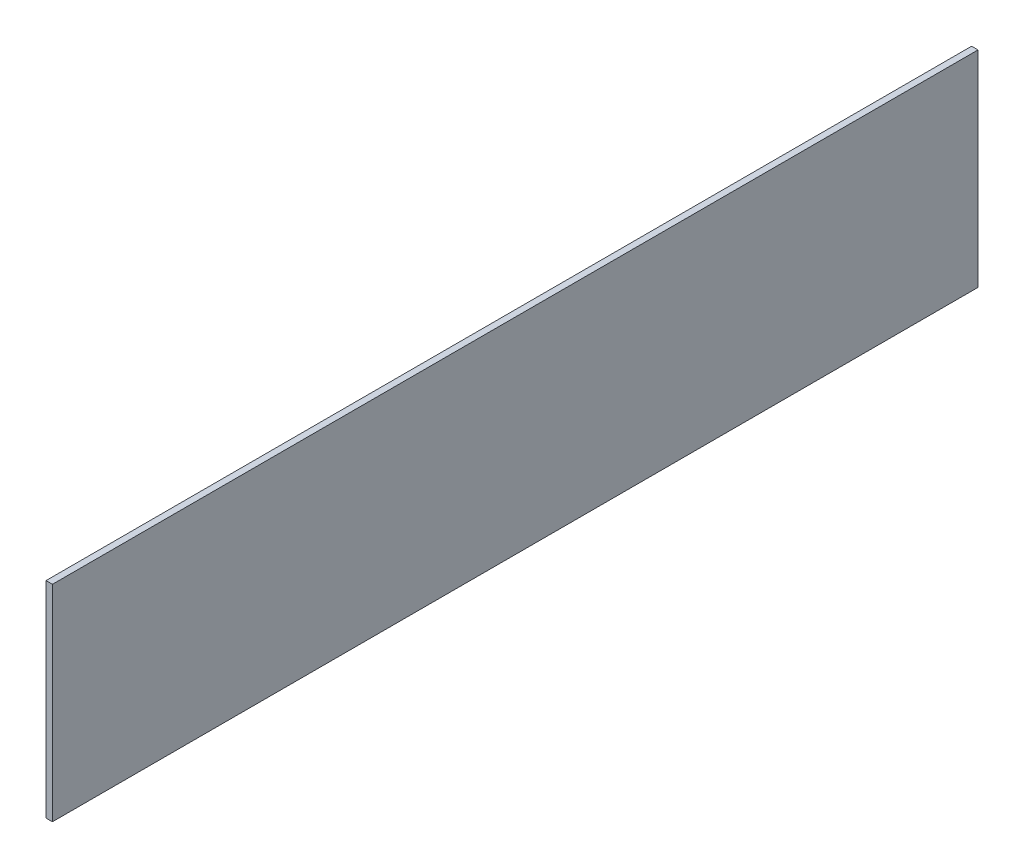
ISO-10303-21;
HEADER;
FILE_DESCRIPTION(('STEP AP214'),'2;1');
FILE_NAME('part.step','',(''),(''),'','','');
FILE_SCHEMA(('AUTOMOTIVE_DESIGN { 1 0 10303 214 1 1 1 1 }'));
ENDSEC;
DATA;
#1=APPLICATION_CONTEXT('core data for automotive mechanical design processes');
#2=APPLICATION_PROTOCOL_DEFINITION('international standard','automotive_design',2000,#1);
#3=PRODUCT_CONTEXT('',#1,'mechanical');
#4=PRODUCT('Part','Part','',(#3));
#5=PRODUCT_RELATED_PRODUCT_CATEGORY('part','',(#4));
#6=PRODUCT_DEFINITION_FORMATION('','',#4);
#7=PRODUCT_DEFINITION_CONTEXT('part definition',#1,'design');
#8=PRODUCT_DEFINITION('design','',#6,#7);
#9=PRODUCT_DEFINITION_SHAPE('','',#8);
#10=(LENGTH_UNIT() NAMED_UNIT(*) SI_UNIT(.MILLI.,.METRE.));
#11=(NAMED_UNIT(*) PLANE_ANGLE_UNIT() SI_UNIT($,.RADIAN.));
#12=(NAMED_UNIT(*) SI_UNIT($,.STERADIAN.) SOLID_ANGLE_UNIT());
#13=UNCERTAINTY_MEASURE_WITH_UNIT(LENGTH_MEASURE(1.E-05),#10,'distance_accuracy_value','');
#14=(GEOMETRIC_REPRESENTATION_CONTEXT(3) GLOBAL_UNCERTAINTY_ASSIGNED_CONTEXT((#13)) GLOBAL_UNIT_ASSIGNED_CONTEXT((#10,
#11,#12)) REPRESENTATION_CONTEXT('',''));
#15=CARTESIAN_POINT('',(0.,0.,0.));
#16=DIRECTION('',(0.,0.,1.));
#17=DIRECTION('',(1.,0.,0.));
#18=AXIS2_PLACEMENT_3D('',#15,#16,#17);
#19=CARTESIAN_POINT('',(0.79375,-25.4,114.3));
#20=DIRECTION('',(0.,0.,-1.));
#21=DIRECTION('',(-1.,0.,0.));
#22=AXIS2_PLACEMENT_3D('',#19,#20,#21);
#23=PLANE('',#22);
#24=DIRECTION('',(0.,-1.,0.));
#25=VECTOR('',#24,1.);
#26=CARTESIAN_POINT('',(-0.79375,-25.4,114.3));
#27=LINE('',#26,#25);
#28=CARTESIAN_POINT('',(-0.79375,25.4,114.3));
#29=VERTEX_POINT('',#28);
#30=CARTESIAN_POINT('',(-0.79375,-25.4,114.3));
#31=VERTEX_POINT('',#30);
#32=EDGE_CURVE('E107',#29,#31,#27,.T.);
#33=ORIENTED_EDGE('',*,*,#32,.T.);
#34=DIRECTION('',(-1.,0.,0.));
#35=VECTOR('',#34,1.);
#36=CARTESIAN_POINT('',(0.79375,-25.4,114.3));
#37=LINE('',#36,#35);
#38=CARTESIAN_POINT('',(0.79375,-25.4,114.3));
#39=VERTEX_POINT('',#38);
#40=EDGE_CURVE('E11',#39,#31,#37,.T.);
#41=ORIENTED_EDGE('',*,*,#40,.F.);
#42=DIRECTION('',(0.,-1.,0.));
#43=VECTOR('',#42,1.);
#44=CARTESIAN_POINT('',(0.79375,-25.4,114.3));
#45=LINE('',#44,#43);
#46=CARTESIAN_POINT('',(0.79375,25.4,114.3));
#47=VERTEX_POINT('',#46);
#48=EDGE_CURVE('E91',#47,#39,#45,.T.);
#49=ORIENTED_EDGE('',*,*,#48,.F.);
#50=DIRECTION('',(-1.,0.,0.));
#51=VECTOR('',#50,1.);
#52=CARTESIAN_POINT('',(0.79375,25.4,114.3));
#53=LINE('',#52,#51);
#54=EDGE_CURVE('E103',#47,#29,#53,.T.);
#55=ORIENTED_EDGE('',*,*,#54,.T.);
#56=EDGE_LOOP('',(#33,#41,#49,#55));
#57=FACE_BOUND('',#56,.T.);
#58=ADVANCED_FACE('F39',(#57),#23,.F.);
#59=CARTESIAN_POINT('',(0.79375,-25.4,-114.3));
#60=DIRECTION('',(0.,1.,0.));
#61=DIRECTION('',(0.,0.,1.));
#62=AXIS2_PLACEMENT_3D('',#59,#60,#61);
#63=PLANE('',#62);
#64=DIRECTION('',(0.,0.,-1.));
#65=VECTOR('',#64,1.);
#66=CARTESIAN_POINT('',(-0.79375,-25.4,-114.3));
#67=LINE('',#66,#65);
#68=CARTESIAN_POINT('',(-0.79375,-25.4,-114.3));
#69=VERTEX_POINT('',#68);
#70=EDGE_CURVE('E96',#31,#69,#67,.T.);
#71=ORIENTED_EDGE('',*,*,#70,.T.);
#72=DIRECTION('',(-1.,0.,0.));
#73=VECTOR('',#72,1.);
#74=CARTESIAN_POINT('',(0.79375,-25.4,-114.3));
#75=LINE('',#74,#73);
#76=CARTESIAN_POINT('',(0.79375,-25.4,-114.3));
#77=VERTEX_POINT('',#76);
#78=EDGE_CURVE('E48',#77,#69,#75,.T.);
#79=ORIENTED_EDGE('',*,*,#78,.F.);
#80=DIRECTION('',(0.,0.,-1.));
#81=VECTOR('',#80,1.);
#82=CARTESIAN_POINT('',(0.79375,-25.4,-114.3));
#83=LINE('',#82,#81);
#84=EDGE_CURVE('E86',#39,#77,#83,.T.);
#85=ORIENTED_EDGE('',*,*,#84,.F.);
#86=ORIENTED_EDGE('',*,*,#40,.T.);
#87=EDGE_LOOP('',(#71,#79,#85,#86));
#88=FACE_BOUND('',#87,.T.);
#89=ADVANCED_FACE('F95',(#88),#63,.F.);
#90=CARTESIAN_POINT('',(0.79375,-25.4,-114.3));
#91=DIRECTION('',(0.,0.,1.));
#92=DIRECTION('',(1.,0.,0.));
#93=AXIS2_PLACEMENT_3D('',#90,#91,#92);
#94=PLANE('',#93);
#95=DIRECTION('',(0.,1.,0.));
#96=VECTOR('',#95,1.);
#97=CARTESIAN_POINT('',(-0.79375,-25.4,-114.3));
#98=LINE('',#97,#96);
#99=CARTESIAN_POINT('',(-0.79375,25.4,-114.3));
#100=VERTEX_POINT('',#99);
#101=EDGE_CURVE('E73',#69,#100,#98,.T.);
#102=ORIENTED_EDGE('',*,*,#101,.T.);
#103=DIRECTION('',(-1.,0.,0.));
#104=VECTOR('',#103,1.);
#105=CARTESIAN_POINT('',(0.79375,25.4,-114.3));
#106=LINE('',#105,#104);
#107=CARTESIAN_POINT('',(0.79375,25.4,-114.3));
#108=VERTEX_POINT('',#107);
#109=EDGE_CURVE('E98',#108,#100,#106,.T.);
#110=ORIENTED_EDGE('',*,*,#109,.F.);
#111=DIRECTION('',(0.,1.,0.));
#112=VECTOR('',#111,1.);
#113=CARTESIAN_POINT('',(0.79375,-25.4,-114.3));
#114=LINE('',#113,#112);
#115=EDGE_CURVE('E89',#77,#108,#114,.T.);
#116=ORIENTED_EDGE('',*,*,#115,.F.);
#117=ORIENTED_EDGE('',*,*,#78,.T.);
#118=EDGE_LOOP('',(#102,#110,#116,#117));
#119=FACE_BOUND('',#118,.T.);
#120=ADVANCED_FACE('F99',(#119),#94,.F.);
#121=CARTESIAN_POINT('',(0.79375,25.4,-114.3));
#122=DIRECTION('',(0.,-1.,0.));
#123=DIRECTION('',(0.,0.,-1.));
#124=AXIS2_PLACEMENT_3D('',#121,#122,#123);
#125=PLANE('',#124);
#126=DIRECTION('',(0.,0.,1.));
#127=VECTOR('',#126,1.);
#128=CARTESIAN_POINT('',(-0.79375,25.4,-114.3));
#129=LINE('',#128,#127);
#130=EDGE_CURVE('E79',#100,#29,#129,.T.);
#131=ORIENTED_EDGE('',*,*,#130,.T.);
#132=ORIENTED_EDGE('',*,*,#54,.F.);
#133=DIRECTION('',(0.,0.,1.));
#134=VECTOR('',#133,1.);
#135=CARTESIAN_POINT('',(0.79375,25.4,-114.3));
#136=LINE('',#135,#134);
#137=EDGE_CURVE('E56',#108,#47,#136,.T.);
#138=ORIENTED_EDGE('',*,*,#137,.F.);
#139=ORIENTED_EDGE('',*,*,#109,.T.);
#140=EDGE_LOOP('',(#131,#132,#138,#139));
#141=FACE_BOUND('',#140,.T.);
#142=ADVANCED_FACE('F120',(#141),#125,.F.);
#143=CARTESIAN_POINT('',(0.79375,0.,0.));
#144=DIRECTION('',(1.,0.,0.));
#145=DIRECTION('',(0.,0.,-1.));
#146=AXIS2_PLACEMENT_3D('',#143,#144,#145);
#147=PLANE('',#146);
#148=ORIENTED_EDGE('',*,*,#48,.T.);
#149=ORIENTED_EDGE('',*,*,#84,.T.);
#150=ORIENTED_EDGE('',*,*,#115,.T.);
#151=ORIENTED_EDGE('',*,*,#137,.T.);
#152=EDGE_LOOP('',(#148,#149,#150,#151));
#153=FACE_BOUND('',#152,.T.);
#154=ADVANCED_FACE('F87',(#153),#147,.T.);
#155=CARTESIAN_POINT('',(-0.79375,0.,0.));
#156=DIRECTION('',(1.,0.,0.));
#157=DIRECTION('',(0.,0.,-1.));
#158=AXIS2_PLACEMENT_3D('',#155,#156,#157);
#159=PLANE('',#158);
#160=ORIENTED_EDGE('',*,*,#32,.F.);
#161=ORIENTED_EDGE('',*,*,#130,.F.);
#162=ORIENTED_EDGE('',*,*,#101,.F.);
#163=ORIENTED_EDGE('',*,*,#70,.F.);
#164=EDGE_LOOP('',(#160,#161,#162,#163));
#165=FACE_BOUND('',#164,.T.);
#166=ADVANCED_FACE('F123',(#165),#159,.F.);
#167=CLOSED_SHELL('',(#58,#89,#120,#142,#154,#166));
#168=MANIFOLD_SOLID_BREP('B2',#167);
#169=ADVANCED_BREP_SHAPE_REPRESENTATION('',(#18,#168),#14);
#170=SHAPE_DEFINITION_REPRESENTATION(#9,#169);
ENDSEC;
END-ISO-10303-21;
